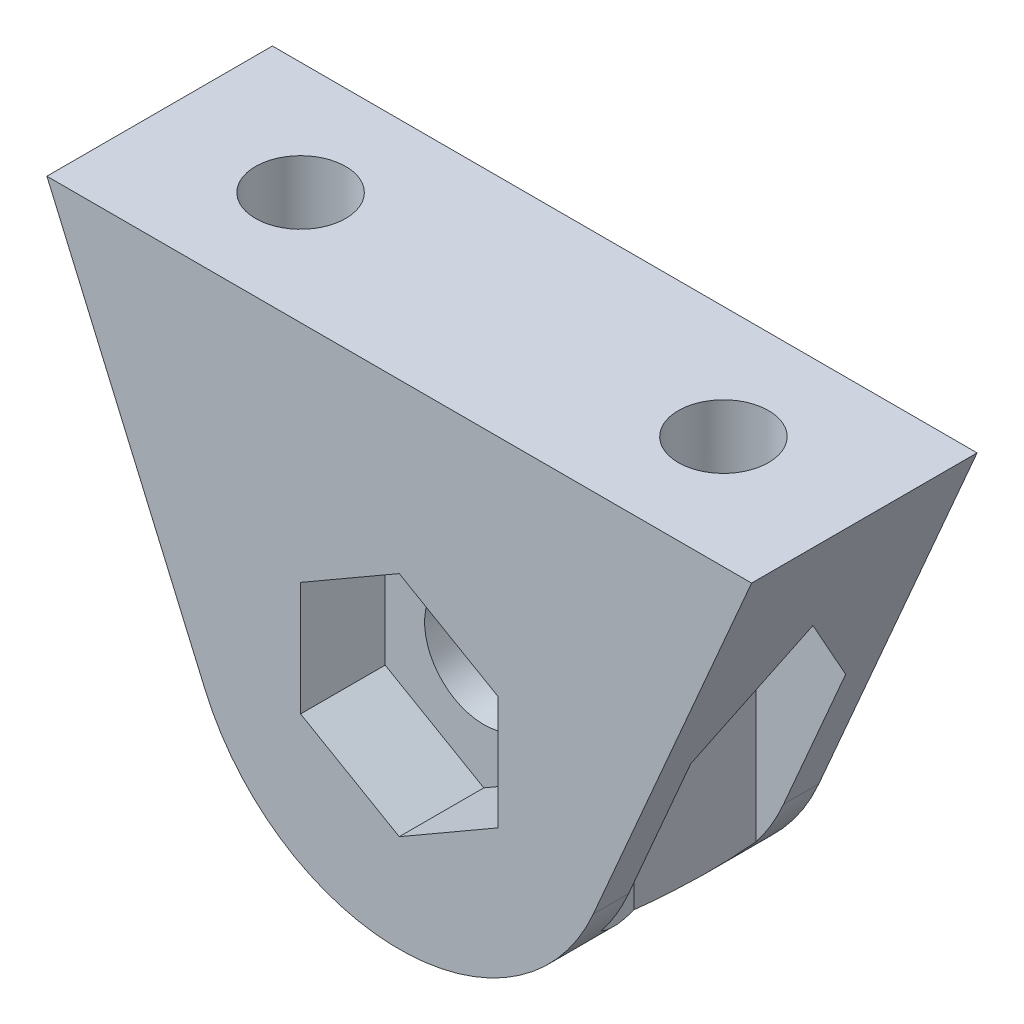
ISO-10303-21;
HEADER;
FILE_DESCRIPTION(('STEP AP214'),'2;1');
FILE_NAME('part.step','',(''),(''),'','','');
FILE_SCHEMA(('AUTOMOTIVE_DESIGN { 1 0 10303 214 1 1 1 1 }'));
ENDSEC;
DATA;
#1=APPLICATION_CONTEXT('core data for automotive mechanical design processes');
#2=APPLICATION_PROTOCOL_DEFINITION('international standard','automotive_design',2000,#1);
#3=PRODUCT_CONTEXT('',#1,'mechanical');
#4=PRODUCT('Part','Part','',(#3));
#5=PRODUCT_RELATED_PRODUCT_CATEGORY('part','',(#4));
#6=PRODUCT_DEFINITION_FORMATION('','',#4);
#7=PRODUCT_DEFINITION_CONTEXT('part definition',#1,'design');
#8=PRODUCT_DEFINITION('design','',#6,#7);
#9=PRODUCT_DEFINITION_SHAPE('','',#8);
#10=(LENGTH_UNIT() NAMED_UNIT(*) SI_UNIT(.MILLI.,.METRE.));
#11=(NAMED_UNIT(*) PLANE_ANGLE_UNIT() SI_UNIT($,.RADIAN.));
#12=(NAMED_UNIT(*) SI_UNIT($,.STERADIAN.) SOLID_ANGLE_UNIT());
#13=UNCERTAINTY_MEASURE_WITH_UNIT(LENGTH_MEASURE(1.E-05),#10,'distance_accuracy_value','');
#14=(GEOMETRIC_REPRESENTATION_CONTEXT(3) GLOBAL_UNCERTAINTY_ASSIGNED_CONTEXT((#13)) GLOBAL_UNIT_ASSIGNED_CONTEXT((#10,
#11,#12)) REPRESENTATION_CONTEXT('',''));
#15=CARTESIAN_POINT('',(0.,0.,0.));
#16=DIRECTION('',(0.,0.,1.));
#17=DIRECTION('',(1.,0.,0.));
#18=AXIS2_PLACEMENT_3D('',#15,#16,#17);
#19=CARTESIAN_POINT('',(7.5,-7.5,4.));
#20=DIRECTION('',(0.,1.,0.));
#21=DIRECTION('',(0.,0.,1.));
#22=AXIS2_PLACEMENT_3D('',#19,#20,#21);
#23=CYLINDRICAL_SURFACE('',#22,1.6);
#24=CARTESIAN_POINT('',(7.5,10.,4.));
#25=DIRECTION('',(0.,1.,0.));
#26=DIRECTION('',(0.,0.,1.));
#27=AXIS2_PLACEMENT_3D('',#24,#25,#26);
#28=CIRCLE('',#27,1.6);
#29=CARTESIAN_POINT('',(7.5,10.,5.6));
#30=VERTEX_POINT('',#29);
#31=EDGE_CURVE('E330',#30,#30,#28,.T.);
#32=ORIENTED_EDGE('',*,*,#31,.T.);
#33=EDGE_LOOP('',(#32));
#34=FACE_BOUND('',#33,.T.);
#35=CARTESIAN_POINT('',(7.5,7.,4.));
#36=DIRECTION('',(0.,-1.,0.));
#37=DIRECTION('',(0.,0.,-1.));
#38=AXIS2_PLACEMENT_3D('',#35,#36,#37);
#39=CIRCLE('',#38,1.6);
#40=CARTESIAN_POINT('',(7.5,7.,2.4));
#41=VERTEX_POINT('',#40);
#42=EDGE_CURVE('E233',#41,#41,#39,.F.);
#43=ORIENTED_EDGE('',*,*,#42,.F.);
#44=EDGE_LOOP('',(#43));
#45=FACE_BOUND('',#44,.T.);
#46=ADVANCED_FACE('F32',(#34,#45),#23,.F.);
#47=CARTESIAN_POINT('',(0.,0.,8.));
#48=DIRECTION('',(0.,0.,-1.));
#49=DIRECTION('',(-1.,0.,0.));
#50=AXIS2_PLACEMENT_3D('',#47,#48,#49);
#51=CYLINDRICAL_SURFACE('',#50,2.1);
#52=CARTESIAN_POINT('',(0.,0.,0.));
#53=DIRECTION('',(0.,0.,1.));
#54=DIRECTION('',(1.,0.,0.));
#55=AXIS2_PLACEMENT_3D('',#52,#53,#54);
#56=CIRCLE('',#55,2.1);
#57=CARTESIAN_POINT('',(2.1,0.,0.));
#58=VERTEX_POINT('',#57);
#59=EDGE_CURVE('E329',#58,#58,#56,.T.);
#60=ORIENTED_EDGE('',*,*,#59,.F.);
#61=EDGE_LOOP('',(#60));
#62=FACE_BOUND('',#61,.T.);
#63=CARTESIAN_POINT('',(0.,0.,5.));
#64=DIRECTION('',(0.,0.,1.));
#65=DIRECTION('',(1.,0.,0.));
#66=AXIS2_PLACEMENT_3D('',#63,#64,#65);
#67=CIRCLE('',#66,2.1);
#68=CARTESIAN_POINT('',(2.1,0.,5.));
#69=VERTEX_POINT('',#68);
#70=EDGE_CURVE('E315',#69,#69,#67,.T.);
#71=ORIENTED_EDGE('',*,*,#70,.T.);
#72=EDGE_LOOP('',(#71));
#73=FACE_BOUND('',#72,.T.);
#74=ADVANCED_FACE('F432',(#62,#73),#51,.F.);
#75=CARTESIAN_POINT('',(0.,0.,8.));
#76=DIRECTION('',(0.,0.,1.));
#77=DIRECTION('',(1.,0.,0.));
#78=AXIS2_PLACEMENT_3D('',#75,#76,#77);
#79=PLANE('',#78);
#80=DIRECTION('',(0.866025403784439,-0.5,0.));
#81=VECTOR('',#80,1.);
#82=CARTESIAN_POINT('',(-3.5,-2.02072594216369,8.));
#83=LINE('',#82,#81);
#84=CARTESIAN_POINT('',(-3.5,-2.02072594216369,8.));
#85=VERTEX_POINT('',#84);
#86=CARTESIAN_POINT('',(0.,-4.04145188432738,8.));
#87=VERTEX_POINT('',#86);
#88=EDGE_CURVE('E277',#85,#87,#83,.T.);
#89=ORIENTED_EDGE('',*,*,#88,.F.);
#90=DIRECTION('',(0.,-1.,0.));
#91=VECTOR('',#90,1.);
#92=CARTESIAN_POINT('',(-3.5,2.02072594216369,8.));
#93=LINE('',#92,#91);
#94=CARTESIAN_POINT('',(-3.5,2.02072594216369,8.));
#95=VERTEX_POINT('',#94);
#96=EDGE_CURVE('E282',#95,#85,#93,.T.);
#97=ORIENTED_EDGE('',*,*,#96,.F.);
#98=DIRECTION('',(-0.866025403784439,-0.5,0.));
#99=VECTOR('',#98,1.);
#100=CARTESIAN_POINT('',(0.,4.04145188432738,8.));
#101=LINE('',#100,#99);
#102=CARTESIAN_POINT('',(0.,4.04145188432738,8.));
#103=VERTEX_POINT('',#102);
#104=EDGE_CURVE('E308',#103,#95,#101,.T.);
#105=ORIENTED_EDGE('',*,*,#104,.F.);
#106=DIRECTION('',(-0.866025403784439,0.5,0.));
#107=VECTOR('',#106,1.);
#108=CARTESIAN_POINT('',(3.5,2.02072594216369,8.));
#109=LINE('',#108,#107);
#110=CARTESIAN_POINT('',(3.5,2.02072594216369,8.));
#111=VERTEX_POINT('',#110);
#112=EDGE_CURVE('E305',#111,#103,#109,.T.);
#113=ORIENTED_EDGE('',*,*,#112,.F.);
#114=DIRECTION('',(0.,1.,0.));
#115=VECTOR('',#114,1.);
#116=CARTESIAN_POINT('',(3.5,-2.02072594216369,8.));
#117=LINE('',#116,#115);
#118=CARTESIAN_POINT('',(3.5,-2.02072594216369,8.));
#119=VERTEX_POINT('',#118);
#120=EDGE_CURVE('E302',#119,#111,#117,.T.);
#121=ORIENTED_EDGE('',*,*,#120,.F.);
#122=DIRECTION('',(0.866025403784439,0.5,0.));
#123=VECTOR('',#122,1.);
#124=CARTESIAN_POINT('',(0.,-4.04145188432738,8.));
#125=LINE('',#124,#123);
#126=EDGE_CURVE('E299',#87,#119,#125,.T.);
#127=ORIENTED_EDGE('',*,*,#126,.F.);
#128=EDGE_LOOP('',(#89,#97,#105,#113,#121,#127));
#129=FACE_BOUND('',#128,.T.);
#130=CARTESIAN_POINT('',(0.,0.,8.));
#131=DIRECTION('',(0.,0.,1.));
#132=DIRECTION('',(1.,0.,0.));
#133=AXIS2_PLACEMENT_3D('',#130,#131,#132);
#134=CIRCLE('',#133,7.5);
#135=CARTESIAN_POINT('',(-6.88306408499442,-2.97883010624303,8.));
#136=VERTEX_POINT('',#135);
#137=CARTESIAN_POINT('',(6.88306408499442,-2.97883010624303,8.));
#138=VERTEX_POINT('',#137);
#139=EDGE_CURVE('E336',#136,#138,#134,.T.);
#140=ORIENTED_EDGE('',*,*,#139,.T.);
#141=DIRECTION('',(0.397177347499071,0.917741877999257,0.));
#142=VECTOR('',#141,1.);
#143=CARTESIAN_POINT('',(6.88306408499442,-2.97883010624303,8.));
#144=LINE('',#143,#142);
#145=CARTESIAN_POINT('',(12.5,10.,8.));
#146=VERTEX_POINT('',#145);
#147=EDGE_CURVE('E339',#138,#146,#144,.T.);
#148=ORIENTED_EDGE('',*,*,#147,.T.);
#149=DIRECTION('',(-1.,0.,0.));
#150=VECTOR('',#149,1.);
#151=CARTESIAN_POINT('',(-12.5,10.,8.));
#152=LINE('',#151,#150);
#153=CARTESIAN_POINT('',(-12.5,10.,8.));
#154=VERTEX_POINT('',#153);
#155=EDGE_CURVE('E342',#146,#154,#152,.T.);
#156=ORIENTED_EDGE('',*,*,#155,.T.);
#157=DIRECTION('',(0.397177347499071,-0.917741877999257,0.));
#158=VECTOR('',#157,1.);
#159=CARTESIAN_POINT('',(-6.88306408499442,-2.97883010624303,8.));
#160=LINE('',#159,#158);
#161=EDGE_CURVE('E344',#154,#136,#160,.T.);
#162=ORIENTED_EDGE('',*,*,#161,.T.);
#163=EDGE_LOOP('',(#140,#148,#156,#162));
#164=FACE_BOUND('',#163,.T.);
#165=ADVANCED_FACE('F438',(#129,#164),#79,.T.);
#166=CARTESIAN_POINT('',(0.,0.,0.));
#167=DIRECTION('',(0.,0.,1.));
#168=DIRECTION('',(1.,0.,0.));
#169=AXIS2_PLACEMENT_3D('',#166,#167,#168);
#170=PLANE('',#169);
#171=CARTESIAN_POINT('',(0.,0.,0.));
#172=DIRECTION('',(0.,0.,1.));
#173=DIRECTION('',(1.,0.,0.));
#174=AXIS2_PLACEMENT_3D('',#171,#172,#173);
#175=CIRCLE('',#174,7.5);
#176=CARTESIAN_POINT('',(-6.88306408499442,-2.97883010624303,0.));
#177=VERTEX_POINT('',#176);
#178=CARTESIAN_POINT('',(6.88306408499442,-2.97883010624303,0.));
#179=VERTEX_POINT('',#178);
#180=EDGE_CURVE('E335',#177,#179,#175,.T.);
#181=ORIENTED_EDGE('',*,*,#180,.F.);
#182=DIRECTION('',(0.397177347499071,-0.917741877999257,0.));
#183=VECTOR('',#182,1.);
#184=CARTESIAN_POINT('',(-6.88306408499442,-2.97883010624303,0.));
#185=LINE('',#184,#183);
#186=CARTESIAN_POINT('',(-12.5,10.,0.));
#187=VERTEX_POINT('',#186);
#188=EDGE_CURVE('E340',#187,#177,#185,.T.);
#189=ORIENTED_EDGE('',*,*,#188,.F.);
#190=DIRECTION('',(-1.,0.,0.));
#191=VECTOR('',#190,1.);
#192=CARTESIAN_POINT('',(-12.5,10.,0.));
#193=LINE('',#192,#191);
#194=CARTESIAN_POINT('',(12.5,10.,0.));
#195=VERTEX_POINT('',#194);
#196=EDGE_CURVE('E351',#195,#187,#193,.T.);
#197=ORIENTED_EDGE('',*,*,#196,.F.);
#198=DIRECTION('',(0.397177347499071,0.917741877999257,0.));
#199=VECTOR('',#198,1.);
#200=CARTESIAN_POINT('',(6.88306408499442,-2.97883010624303,0.));
#201=LINE('',#200,#199);
#202=EDGE_CURVE('E349',#179,#195,#201,.T.);
#203=ORIENTED_EDGE('',*,*,#202,.F.);
#204=EDGE_LOOP('',(#181,#189,#197,#203));
#205=FACE_BOUND('',#204,.T.);
#206=ORIENTED_EDGE('',*,*,#59,.T.);
#207=EDGE_LOOP('',(#206));
#208=FACE_BOUND('',#207,.T.);
#209=ADVANCED_FACE('F448',(#205,#208),#170,.F.);
#210=CARTESIAN_POINT('',(0.,0.,8.));
#211=DIRECTION('',(0.,0.,-1.));
#212=DIRECTION('',(-1.,0.,0.));
#213=AXIS2_PLACEMENT_3D('',#210,#211,#212);
#214=CYLINDRICAL_SURFACE('',#213,7.5);
#215=DIRECTION('',(0.,0.,-1.));
#216=VECTOR('',#215,1.);
#217=CARTESIAN_POINT('',(-6.88306408499442,-2.97883010624303,8.));
#218=LINE('',#217,#216);
#219=CARTESIAN_POINT('',(-6.88306408499442,-2.97883010624303,6.75));
#220=VERTEX_POINT('',#219);
#221=EDGE_CURVE('E355',#136,#220,#218,.T.);
#222=ORIENTED_EDGE('',*,*,#221,.T.);
#223=CARTESIAN_POINT('',(0.,0.,6.75));
#224=DIRECTION('',(0.,0.,1.));
#225=DIRECTION('',(1.,0.,0.));
#226=AXIS2_PLACEMENT_3D('',#223,#224,#225);
#227=CIRCLE('',#226,7.5);
#228=CARTESIAN_POINT('',(-5.91228675972853,-4.61463598464047,6.75));
#229=VERTEX_POINT('',#228);
#230=EDGE_CURVE('E268',#220,#229,#227,.T.);
#231=ORIENTED_EDGE('',*,*,#230,.T.);
#232=CARTESIAN_POINT('',(0.,0.,-3.49038105676658));
#233=DIRECTION('',(0.866025403784439,0.,0.5));
#234=DIRECTION('',(0.5,0.,-0.866025403784439));
#235=AXIS2_PLACEMENT_3D('',#232,#233,#234);
#236=ELLIPSE('',#235,15.,7.5);
#237=CARTESIAN_POINT('',(-4.32457351945706,-6.12764749922927,4.));
#238=VERTEX_POINT('',#237);
#239=EDGE_CURVE('E40',#229,#238,#236,.T.);
#240=ORIENTED_EDGE('',*,*,#239,.T.);
#241=CARTESIAN_POINT('',(0.,0.,11.4903810567666));
#242=DIRECTION('',(0.866025403784439,0.,-0.5));
#243=DIRECTION('',(-0.5,0.,-0.866025403784439));
#244=AXIS2_PLACEMENT_3D('',#241,#242,#243);
#245=ELLIPSE('',#244,15.,7.5);
#246=CARTESIAN_POINT('',(-5.91228675972853,-4.61463598464047,1.25));
#247=VERTEX_POINT('',#246);
#248=EDGE_CURVE('E11',#238,#247,#245,.T.);
#249=ORIENTED_EDGE('',*,*,#248,.T.);
#250=CARTESIAN_POINT('',(0.,0.,1.25));
#251=DIRECTION('',(0.,0.,-1.));
#252=DIRECTION('',(-1.,0.,0.));
#253=AXIS2_PLACEMENT_3D('',#250,#251,#252);
#254=CIRCLE('',#253,7.5);
#255=CARTESIAN_POINT('',(-6.88306408499442,-2.97883010624303,1.25));
#256=VERTEX_POINT('',#255);
#257=EDGE_CURVE('E265',#247,#256,#254,.T.);
#258=ORIENTED_EDGE('',*,*,#257,.T.);
#259=EDGE_CURVE('E346',#256,#177,#218,.T.);
#260=ORIENTED_EDGE('',*,*,#259,.T.);
#261=ORIENTED_EDGE('',*,*,#180,.T.);
#262=DIRECTION('',(0.,0.,-1.));
#263=VECTOR('',#262,1.);
#264=CARTESIAN_POINT('',(6.88306408499442,-2.97883010624303,8.));
#265=LINE('',#264,#263);
#266=CARTESIAN_POINT('',(6.88306408499442,-2.97883010624303,1.25));
#267=VERTEX_POINT('',#266);
#268=EDGE_CURVE('E364',#267,#179,#265,.T.);
#269=ORIENTED_EDGE('',*,*,#268,.F.);
#270=CARTESIAN_POINT('',(0.,0.,1.25));
#271=DIRECTION('',(0.,0.,-1.));
#272=DIRECTION('',(-1.,0.,0.));
#273=AXIS2_PLACEMENT_3D('',#270,#271,#272);
#274=CIRCLE('',#273,7.5);
#275=CARTESIAN_POINT('',(5.91228675972853,-4.61463598464047,1.25));
#276=VERTEX_POINT('',#275);
#277=EDGE_CURVE('E271',#267,#276,#274,.T.);
#278=ORIENTED_EDGE('',*,*,#277,.T.);
#279=CARTESIAN_POINT('',(0.,0.,11.4903810567666));
#280=DIRECTION('',(-0.866025403784439,0.,-0.499999999999999));
#281=DIRECTION('',(0.499999999999999,0.,-0.866025403784439));
#282=AXIS2_PLACEMENT_3D('',#279,#280,#281);
#283=ELLIPSE('',#282,15.,7.5);
#284=CARTESIAN_POINT('',(4.32457351945706,-6.12764749922927,4.));
#285=VERTEX_POINT('',#284);
#286=EDGE_CURVE('E398',#276,#285,#283,.T.);
#287=ORIENTED_EDGE('',*,*,#286,.T.);
#288=CARTESIAN_POINT('',(0.,0.,-3.49038105676658));
#289=DIRECTION('',(-0.866025403784438,0.,0.5));
#290=DIRECTION('',(-0.5,0.,-0.866025403784439));
#291=AXIS2_PLACEMENT_3D('',#288,#289,#290);
#292=ELLIPSE('',#291,15.,7.5);
#293=CARTESIAN_POINT('',(5.91228675972853,-4.61463598464047,6.75));
#294=VERTEX_POINT('',#293);
#295=EDGE_CURVE('E401',#285,#294,#292,.T.);
#296=ORIENTED_EDGE('',*,*,#295,.T.);
#297=CARTESIAN_POINT('',(0.,0.,6.75));
#298=DIRECTION('',(0.,0.,1.));
#299=DIRECTION('',(1.,0.,0.));
#300=AXIS2_PLACEMENT_3D('',#297,#298,#299);
#301=CIRCLE('',#300,7.5);
#302=CARTESIAN_POINT('',(6.88306408499442,-2.97883010624303,6.75));
#303=VERTEX_POINT('',#302);
#304=EDGE_CURVE('E274',#294,#303,#301,.T.);
#305=ORIENTED_EDGE('',*,*,#304,.T.);
#306=EDGE_CURVE('E365',#138,#303,#265,.T.);
#307=ORIENTED_EDGE('',*,*,#306,.F.);
#308=ORIENTED_EDGE('',*,*,#139,.F.);
#309=EDGE_LOOP('',(#222,#231,#240,#249,#258,#260,#261,#269,#278,#287,#296,#305,#307,#308));
#310=FACE_BOUND('',#309,.T.);
#311=ADVANCED_FACE('F34',(#310),#214,.T.);
#312=CARTESIAN_POINT('',(6.88306408499442,-2.97883010624303,8.));
#313=DIRECTION('',(-0.917741877999257,0.397177347499071,0.));
#314=DIRECTION('',(-0.397177347499071,-0.917741877999257,0.));
#315=AXIS2_PLACEMENT_3D('',#312,#313,#314);
#316=PLANE('',#315);
#317=ORIENTED_EDGE('',*,*,#306,.T.);
#318=DIRECTION('',(0.397177347499071,0.917741877999257,0.));
#319=VECTOR('',#318,1.);
#320=CARTESIAN_POINT('',(6.88306408499442,-2.97883010624303,6.75));
#321=LINE('',#320,#319);
#322=CARTESIAN_POINT('',(9.08771324027147,2.11536488960366,6.74999999999999));
#323=VERTEX_POINT('',#322);
#324=EDGE_CURVE('E395',#303,#323,#321,.T.);
#325=ORIENTED_EDGE('',*,*,#324,.T.);
#326=DIRECTION('',(0.327224878100445,0.756105493042205,-0.566770114370504));
#327=VECTOR('',#326,1.);
#328=CARTESIAN_POINT('',(7.35943332114477,-1.87810268520925,9.74346862962848));
#329=LINE('',#328,#327);
#330=CARTESIAN_POINT('',(10.6754264805429,5.78403063810643,3.99999999999999));
#331=VERTEX_POINT('',#330);
#332=EDGE_CURVE('E392',#323,#331,#329,.T.);
#333=ORIENTED_EDGE('',*,*,#332,.T.);
#334=DIRECTION('',(-0.327224878100445,-0.756105493042205,-0.566770114370503));
#335=VECTOR('',#334,1.);
#336=CARTESIAN_POINT('',(8.84312357383167,1.55020128893231,0.826358270719947));
#337=LINE('',#336,#335);
#338=CARTESIAN_POINT('',(9.08771324027147,2.11536488960367,1.25));
#339=VERTEX_POINT('',#338);
#340=EDGE_CURVE('E386',#331,#339,#337,.T.);
#341=ORIENTED_EDGE('',*,*,#340,.T.);
#342=DIRECTION('',(-0.397177347499071,-0.917741877999257,0.));
#343=VECTOR('',#342,1.);
#344=CARTESIAN_POINT('',(6.88306408499442,-2.97883010624303,1.25));
#345=LINE('',#344,#343);
#346=EDGE_CURVE('E389',#339,#267,#345,.T.);
#347=ORIENTED_EDGE('',*,*,#346,.T.);
#348=ORIENTED_EDGE('',*,*,#268,.T.);
#349=ORIENTED_EDGE('',*,*,#202,.T.);
#350=DIRECTION('',(0.,0.,-1.));
#351=VECTOR('',#350,1.);
#352=CARTESIAN_POINT('',(12.5,10.,8.));
#353=LINE('',#352,#351);
#354=EDGE_CURVE('E361',#146,#195,#353,.T.);
#355=ORIENTED_EDGE('',*,*,#354,.F.);
#356=ORIENTED_EDGE('',*,*,#147,.F.);
#357=EDGE_LOOP('',(#317,#325,#333,#341,#347,#348,#349,#355,#356));
#358=FACE_BOUND('',#357,.T.);
#359=ADVANCED_FACE('F457',(#358),#316,.F.);
#360=CARTESIAN_POINT('',(-12.5,10.,8.));
#361=DIRECTION('',(0.,-1.,0.));
#362=DIRECTION('',(0.,0.,-1.));
#363=AXIS2_PLACEMENT_3D('',#360,#361,#362);
#364=PLANE('',#363);
#365=CARTESIAN_POINT('',(-7.5,10.,4.));
#366=DIRECTION('',(0.,1.,0.));
#367=DIRECTION('',(0.,0.,1.));
#368=AXIS2_PLACEMENT_3D('',#365,#366,#367);
#369=CIRCLE('',#368,1.6);
#370=CARTESIAN_POINT('',(-7.5,10.,5.6));
#371=VERTEX_POINT('',#370);
#372=EDGE_CURVE('E326',#371,#371,#369,.T.);
#373=ORIENTED_EDGE('',*,*,#372,.F.);
#374=EDGE_LOOP('',(#373));
#375=FACE_BOUND('',#374,.T.);
#376=ORIENTED_EDGE('',*,*,#31,.F.);
#377=EDGE_LOOP('',(#376));
#378=FACE_BOUND('',#377,.T.);
#379=ORIENTED_EDGE('',*,*,#196,.T.);
#380=DIRECTION('',(0.,0.,-1.));
#381=VECTOR('',#380,1.);
#382=CARTESIAN_POINT('',(-12.5,10.,8.));
#383=LINE('',#382,#381);
#384=EDGE_CURVE('E358',#154,#187,#383,.T.);
#385=ORIENTED_EDGE('',*,*,#384,.F.);
#386=ORIENTED_EDGE('',*,*,#155,.F.);
#387=ORIENTED_EDGE('',*,*,#354,.T.);
#388=EDGE_LOOP('',(#379,#385,#386,#387));
#389=FACE_BOUND('',#388,.T.);
#390=ADVANCED_FACE('F455',(#375,#378,#389),#364,.F.);
#391=CARTESIAN_POINT('',(-6.88306408499442,-2.97883010624303,8.));
#392=DIRECTION('',(0.917741877999257,0.397177347499071,0.));
#393=DIRECTION('',(-0.397177347499071,0.917741877999257,0.));
#394=AXIS2_PLACEMENT_3D('',#391,#392,#393);
#395=PLANE('',#394);
#396=DIRECTION('',(0.327224878100445,-0.756105493042205,0.566770114370504));
#397=VECTOR('',#396,1.);
#398=CARTESIAN_POINT('',(-7.35943332114477,-1.87810268520925,9.74346862962848));
#399=LINE('',#398,#397);
#400=CARTESIAN_POINT('',(-10.6754264805429,5.78403063810643,4.));
#401=VERTEX_POINT('',#400);
#402=CARTESIAN_POINT('',(-9.08771324027147,2.11536488960366,6.75));
#403=VERTEX_POINT('',#402);
#404=EDGE_CURVE('E380',#401,#403,#399,.T.);
#405=ORIENTED_EDGE('',*,*,#404,.T.);
#406=DIRECTION('',(0.397177347499071,-0.917741877999257,0.));
#407=VECTOR('',#406,1.);
#408=CARTESIAN_POINT('',(-6.88306408499442,-2.97883010624303,6.75));
#409=LINE('',#408,#407);
#410=EDGE_CURVE('E383',#403,#220,#409,.T.);
#411=ORIENTED_EDGE('',*,*,#410,.T.);
#412=ORIENTED_EDGE('',*,*,#221,.F.);
#413=ORIENTED_EDGE('',*,*,#161,.F.);
#414=ORIENTED_EDGE('',*,*,#384,.T.);
#415=ORIENTED_EDGE('',*,*,#188,.T.);
#416=ORIENTED_EDGE('',*,*,#259,.F.);
#417=DIRECTION('',(-0.397177347499071,0.917741877999257,0.));
#418=VECTOR('',#417,1.);
#419=CARTESIAN_POINT('',(-6.88306408499442,-2.97883010624303,1.25));
#420=LINE('',#419,#418);
#421=CARTESIAN_POINT('',(-9.08771324027147,2.11536488960366,1.25));
#422=VERTEX_POINT('',#421);
#423=EDGE_CURVE('E368',#256,#422,#420,.T.);
#424=ORIENTED_EDGE('',*,*,#423,.T.);
#425=DIRECTION('',(-0.327224878100445,0.756105493042205,0.566770114370503));
#426=VECTOR('',#425,1.);
#427=CARTESIAN_POINT('',(-8.84312357383167,1.55020128893231,0.826358270719948));
#428=LINE('',#427,#426);
#429=EDGE_CURVE('E377',#422,#401,#428,.T.);
#430=ORIENTED_EDGE('',*,*,#429,.T.);
#431=EDGE_LOOP('',(#405,#411,#412,#413,#414,#415,#416,#424,#430));
#432=FACE_BOUND('',#431,.T.);
#433=ADVANCED_FACE('F407',(#432),#395,.F.);
#434=CARTESIAN_POINT('',(-7.5,-7.5,4.));
#435=DIRECTION('',(0.,1.,0.));
#436=DIRECTION('',(0.,0.,1.));
#437=AXIS2_PLACEMENT_3D('',#434,#435,#436);
#438=CYLINDRICAL_SURFACE('',#437,1.6);
#439=CARTESIAN_POINT('',(-7.5,7.,4.));
#440=DIRECTION('',(0.,1.,0.));
#441=DIRECTION('',(0.,0.,1.));
#442=AXIS2_PLACEMENT_3D('',#439,#440,#441);
#443=CIRCLE('',#442,1.6);
#444=CARTESIAN_POINT('',(-7.5,7.,5.6));
#445=VERTEX_POINT('',#444);
#446=EDGE_CURVE('E269',#445,#445,#443,.F.);
#447=ORIENTED_EDGE('',*,*,#446,.T.);
#448=EDGE_LOOP('',(#447));
#449=FACE_BOUND('',#448,.T.);
#450=ORIENTED_EDGE('',*,*,#372,.T.);
#451=EDGE_LOOP('',(#450));
#452=FACE_BOUND('',#451,.T.);
#453=ADVANCED_FACE('F443',(#449,#452),#438,.F.);
#454=CARTESIAN_POINT('',(-3.5,-2.02072594216369,5.));
#455=DIRECTION('',(-0.5,-0.866025403784439,0.));
#456=DIRECTION('',(0.866025403784439,-0.5,0.));
#457=AXIS2_PLACEMENT_3D('',#454,#455,#456);
#458=PLANE('',#457);
#459=ORIENTED_EDGE('',*,*,#88,.T.);
#460=DIRECTION('',(0.,0.,1.));
#461=VECTOR('',#460,1.);
#462=CARTESIAN_POINT('',(0.,-4.04145188432738,5.));
#463=LINE('',#462,#461);
#464=CARTESIAN_POINT('',(0.,-4.04145188432738,5.));
#465=VERTEX_POINT('',#464);
#466=EDGE_CURVE('E297',#465,#87,#463,.T.);
#467=ORIENTED_EDGE('',*,*,#466,.F.);
#468=DIRECTION('',(0.866025403784439,-0.5,0.));
#469=VECTOR('',#468,1.);
#470=CARTESIAN_POINT('',(-3.5,-2.02072594216369,5.));
#471=LINE('',#470,#469);
#472=CARTESIAN_POINT('',(-3.5,-2.02072594216369,5.));
#473=VERTEX_POINT('',#472);
#474=EDGE_CURVE('E278',#473,#465,#471,.T.);
#475=ORIENTED_EDGE('',*,*,#474,.F.);
#476=DIRECTION('',(0.,0.,1.));
#477=VECTOR('',#476,1.);
#478=CARTESIAN_POINT('',(-3.5,-2.02072594216369,5.));
#479=LINE('',#478,#477);
#480=EDGE_CURVE('E313',#473,#85,#479,.T.);
#481=ORIENTED_EDGE('',*,*,#480,.T.);
#482=EDGE_LOOP('',(#459,#467,#475,#481));
#483=FACE_BOUND('',#482,.T.);
#484=ADVANCED_FACE('F510',(#483),#458,.F.);
#485=CARTESIAN_POINT('',(-3.5,2.02072594216369,5.));
#486=DIRECTION('',(-1.,0.,0.));
#487=DIRECTION('',(0.,-1.,0.));
#488=AXIS2_PLACEMENT_3D('',#485,#486,#487);
#489=PLANE('',#488);
#490=ORIENTED_EDGE('',*,*,#96,.T.);
#491=ORIENTED_EDGE('',*,*,#480,.F.);
#492=DIRECTION('',(0.,-1.,0.));
#493=VECTOR('',#492,1.);
#494=CARTESIAN_POINT('',(-3.5,2.02072594216369,5.));
#495=LINE('',#494,#493);
#496=CARTESIAN_POINT('',(-3.5,2.02072594216369,5.));
#497=VERTEX_POINT('',#496);
#498=EDGE_CURVE('E294',#497,#473,#495,.T.);
#499=ORIENTED_EDGE('',*,*,#498,.F.);
#500=DIRECTION('',(0.,0.,1.));
#501=VECTOR('',#500,1.);
#502=CARTESIAN_POINT('',(-3.5,2.02072594216369,5.));
#503=LINE('',#502,#501);
#504=EDGE_CURVE('E316',#497,#95,#503,.T.);
#505=ORIENTED_EDGE('',*,*,#504,.T.);
#506=EDGE_LOOP('',(#490,#491,#499,#505));
#507=FACE_BOUND('',#506,.T.);
#508=ADVANCED_FACE('F528',(#507),#489,.F.);
#509=CARTESIAN_POINT('',(0.,4.04145188432738,5.));
#510=DIRECTION('',(-0.5,0.866025403784438,0.));
#511=DIRECTION('',(-0.866025403784439,-0.5,0.));
#512=AXIS2_PLACEMENT_3D('',#509,#510,#511);
#513=PLANE('',#512);
#514=ORIENTED_EDGE('',*,*,#104,.T.);
#515=ORIENTED_EDGE('',*,*,#504,.F.);
#516=DIRECTION('',(-0.866025403784439,-0.5,0.));
#517=VECTOR('',#516,1.);
#518=CARTESIAN_POINT('',(0.,4.04145188432738,5.));
#519=LINE('',#518,#517);
#520=CARTESIAN_POINT('',(0.,4.04145188432738,5.));
#521=VERTEX_POINT('',#520);
#522=EDGE_CURVE('E291',#521,#497,#519,.T.);
#523=ORIENTED_EDGE('',*,*,#522,.F.);
#524=DIRECTION('',(0.,0.,1.));
#525=VECTOR('',#524,1.);
#526=CARTESIAN_POINT('',(0.,4.04145188432738,5.));
#527=LINE('',#526,#525);
#528=EDGE_CURVE('E318',#521,#103,#527,.T.);
#529=ORIENTED_EDGE('',*,*,#528,.T.);
#530=EDGE_LOOP('',(#514,#515,#523,#529));
#531=FACE_BOUND('',#530,.T.);
#532=ADVANCED_FACE('F525',(#531),#513,.F.);
#533=CARTESIAN_POINT('',(3.5,2.02072594216369,5.));
#534=DIRECTION('',(0.5,0.866025403784439,0.));
#535=DIRECTION('',(-0.866025403784439,0.5,0.));
#536=AXIS2_PLACEMENT_3D('',#533,#534,#535);
#537=PLANE('',#536);
#538=ORIENTED_EDGE('',*,*,#112,.T.);
#539=ORIENTED_EDGE('',*,*,#528,.F.);
#540=DIRECTION('',(-0.866025403784439,0.5,0.));
#541=VECTOR('',#540,1.);
#542=CARTESIAN_POINT('',(3.5,2.02072594216369,5.));
#543=LINE('',#542,#541);
#544=CARTESIAN_POINT('',(3.5,2.02072594216369,5.));
#545=VERTEX_POINT('',#544);
#546=EDGE_CURVE('E288',#545,#521,#543,.T.);
#547=ORIENTED_EDGE('',*,*,#546,.F.);
#548=DIRECTION('',(0.,0.,1.));
#549=VECTOR('',#548,1.);
#550=CARTESIAN_POINT('',(3.5,2.02072594216369,5.));
#551=LINE('',#550,#549);
#552=EDGE_CURVE('E320',#545,#111,#551,.T.);
#553=ORIENTED_EDGE('',*,*,#552,.T.);
#554=EDGE_LOOP('',(#538,#539,#547,#553));
#555=FACE_BOUND('',#554,.T.);
#556=ADVANCED_FACE('F521',(#555),#537,.F.);
#557=CARTESIAN_POINT('',(3.5,-2.02072594216369,5.));
#558=DIRECTION('',(1.,0.,0.));
#559=DIRECTION('',(0.,1.,0.));
#560=AXIS2_PLACEMENT_3D('',#557,#558,#559);
#561=PLANE('',#560);
#562=ORIENTED_EDGE('',*,*,#120,.T.);
#563=ORIENTED_EDGE('',*,*,#552,.F.);
#564=DIRECTION('',(0.,1.,0.));
#565=VECTOR('',#564,1.);
#566=CARTESIAN_POINT('',(3.5,-2.02072594216369,5.));
#567=LINE('',#566,#565);
#568=CARTESIAN_POINT('',(3.5,-2.02072594216369,5.));
#569=VERTEX_POINT('',#568);
#570=EDGE_CURVE('E285',#569,#545,#567,.T.);
#571=ORIENTED_EDGE('',*,*,#570,.F.);
#572=DIRECTION('',(0.,0.,1.));
#573=VECTOR('',#572,1.);
#574=CARTESIAN_POINT('',(3.5,-2.02072594216369,5.));
#575=LINE('',#574,#573);
#576=EDGE_CURVE('E322',#569,#119,#575,.T.);
#577=ORIENTED_EDGE('',*,*,#576,.T.);
#578=EDGE_LOOP('',(#562,#563,#571,#577));
#579=FACE_BOUND('',#578,.T.);
#580=ADVANCED_FACE('F517',(#579),#561,.F.);
#581=CARTESIAN_POINT('',(0.,-4.04145188432738,5.));
#582=DIRECTION('',(0.5,-0.866025403784438,0.));
#583=DIRECTION('',(0.866025403784439,0.5,0.));
#584=AXIS2_PLACEMENT_3D('',#581,#582,#583);
#585=PLANE('',#584);
#586=ORIENTED_EDGE('',*,*,#126,.T.);
#587=ORIENTED_EDGE('',*,*,#576,.F.);
#588=DIRECTION('',(0.866025403784439,0.5,0.));
#589=VECTOR('',#588,1.);
#590=CARTESIAN_POINT('',(0.,-4.04145188432738,5.));
#591=LINE('',#590,#589);
#592=EDGE_CURVE('E281',#465,#569,#591,.T.);
#593=ORIENTED_EDGE('',*,*,#592,.F.);
#594=ORIENTED_EDGE('',*,*,#466,.T.);
#595=EDGE_LOOP('',(#586,#587,#593,#594));
#596=FACE_BOUND('',#595,.T.);
#597=ADVANCED_FACE('F504',(#596),#585,.F.);
#598=CARTESIAN_POINT('',(0.,0.,5.));
#599=DIRECTION('',(0.,0.,1.));
#600=DIRECTION('',(1.,0.,0.));
#601=AXIS2_PLACEMENT_3D('',#598,#599,#600);
#602=PLANE('',#601);
#603=ORIENTED_EDGE('',*,*,#70,.F.);
#604=EDGE_LOOP('',(#603));
#605=FACE_BOUND('',#604,.T.);
#606=ORIENTED_EDGE('',*,*,#474,.T.);
#607=ORIENTED_EDGE('',*,*,#592,.T.);
#608=ORIENTED_EDGE('',*,*,#570,.T.);
#609=ORIENTED_EDGE('',*,*,#546,.T.);
#610=ORIENTED_EDGE('',*,*,#522,.T.);
#611=ORIENTED_EDGE('',*,*,#498,.T.);
#612=EDGE_LOOP('',(#606,#607,#608,#609,#610,#611));
#613=FACE_BOUND('',#612,.T.);
#614=ADVANCED_FACE('F501',(#605,#613),#602,.T.);
#615=CARTESIAN_POINT('',(5.91228675972853,-7.5,6.75));
#616=DIRECTION('',(-0.866025403784438,0.,0.5));
#617=DIRECTION('',(0.5,0.,0.866025403784439));
#618=AXIS2_PLACEMENT_3D('',#615,#616,#617);
#619=PLANE('',#618);
#620=DIRECTION('',(0.,1.,0.));
#621=VECTOR('',#620,1.);
#622=CARTESIAN_POINT('',(4.32457351945706,-7.5,4.));
#623=LINE('',#622,#621);
#624=CARTESIAN_POINT('',(4.32457351945706,7.,4.));
#625=VERTEX_POINT('',#624);
#626=EDGE_CURVE('E259',#285,#625,#623,.T.);
#627=ORIENTED_EDGE('',*,*,#626,.T.);
#628=DIRECTION('',(0.5,0.,0.866025403784438));
#629=VECTOR('',#628,1.);
#630=CARTESIAN_POINT('',(5.91228675972853,7.,6.75));
#631=LINE('',#630,#629);
#632=CARTESIAN_POINT('',(5.91228675972853,7.,6.75));
#633=VERTEX_POINT('',#632);
#634=EDGE_CURVE('E251',#625,#633,#631,.T.);
#635=ORIENTED_EDGE('',*,*,#634,.T.);
#636=DIRECTION('',(0.,1.,0.));
#637=VECTOR('',#636,1.);
#638=CARTESIAN_POINT('',(5.91228675972853,-7.5,6.75));
#639=LINE('',#638,#637);
#640=EDGE_CURVE('E222',#294,#633,#639,.T.);
#641=ORIENTED_EDGE('',*,*,#640,.F.);
#642=ORIENTED_EDGE('',*,*,#295,.F.);
#643=EDGE_LOOP('',(#627,#635,#641,#642));
#644=FACE_BOUND('',#643,.T.);
#645=ADVANCED_FACE('F471',(#644),#619,.F.);
#646=CARTESIAN_POINT('',(4.32457351945706,-7.5,4.));
#647=DIRECTION('',(-0.866025403784439,0.,-0.499999999999999));
#648=DIRECTION('',(-0.499999999999999,0.,0.866025403784439));
#649=AXIS2_PLACEMENT_3D('',#646,#647,#648);
#650=PLANE('',#649);
#651=DIRECTION('',(0.,1.,0.));
#652=VECTOR('',#651,1.);
#653=CARTESIAN_POINT('',(5.91228675972853,-7.5,1.25));
#654=LINE('',#653,#652);
#655=CARTESIAN_POINT('',(5.91228675972853,7.,1.25));
#656=VERTEX_POINT('',#655);
#657=EDGE_CURVE('E261',#276,#656,#654,.T.);
#658=ORIENTED_EDGE('',*,*,#657,.T.);
#659=DIRECTION('',(-0.499999999999999,0.,0.866025403784439));
#660=VECTOR('',#659,1.);
#661=CARTESIAN_POINT('',(4.32457351945706,7.,4.));
#662=LINE('',#661,#660);
#663=EDGE_CURVE('E248',#656,#625,#662,.T.);
#664=ORIENTED_EDGE('',*,*,#663,.T.);
#665=ORIENTED_EDGE('',*,*,#626,.F.);
#666=ORIENTED_EDGE('',*,*,#286,.F.);
#667=EDGE_LOOP('',(#658,#664,#665,#666));
#668=FACE_BOUND('',#667,.T.);
#669=ADVANCED_FACE('F557',(#668),#650,.F.);
#670=CARTESIAN_POINT('',(10.6754264805429,-7.5,4.));
#671=DIRECTION('',(0.866025403784439,0.,0.5));
#672=DIRECTION('',(0.5,0.,-0.866025403784439));
#673=AXIS2_PLACEMENT_3D('',#670,#671,#672);
#674=PLANE('',#673);
#675=DIRECTION('',(0.,1.,0.));
#676=VECTOR('',#675,1.);
#677=CARTESIAN_POINT('',(9.08771324027147,-7.5,6.74999999999999));
#678=LINE('',#677,#676);
#679=CARTESIAN_POINT('',(9.08771324027147,7.,6.74999999999999));
#680=VERTEX_POINT('',#679);
#681=EDGE_CURVE('E220',#323,#680,#678,.T.);
#682=ORIENTED_EDGE('',*,*,#681,.T.);
#683=DIRECTION('',(0.5,0.,-0.866025403784439));
#684=VECTOR('',#683,1.);
#685=CARTESIAN_POINT('',(10.6754264805429,7.,4.));
#686=LINE('',#685,#684);
#687=CARTESIAN_POINT('',(10.6754264805429,7.,4.));
#688=VERTEX_POINT('',#687);
#689=EDGE_CURVE('E240',#680,#688,#686,.T.);
#690=ORIENTED_EDGE('',*,*,#689,.T.);
#691=DIRECTION('',(0.,1.,0.));
#692=VECTOR('',#691,1.);
#693=CARTESIAN_POINT('',(10.6754264805429,-7.5,4.));
#694=LINE('',#693,#692);
#695=EDGE_CURVE('E256',#331,#688,#694,.T.);
#696=ORIENTED_EDGE('',*,*,#695,.F.);
#697=ORIENTED_EDGE('',*,*,#332,.F.);
#698=EDGE_LOOP('',(#682,#690,#696,#697));
#699=FACE_BOUND('',#698,.T.);
#700=ADVANCED_FACE('F480',(#699),#674,.F.);
#701=CARTESIAN_POINT('',(9.08771324027147,-7.5,6.74999999999999));
#702=DIRECTION('',(0.,0.,1.));
#703=DIRECTION('',(1.,0.,0.));
#704=AXIS2_PLACEMENT_3D('',#701,#702,#703);
#705=PLANE('',#704);
#706=ORIENTED_EDGE('',*,*,#640,.T.);
#707=DIRECTION('',(1.,0.,0.));
#708=VECTOR('',#707,1.);
#709=CARTESIAN_POINT('',(9.08771324027147,7.,6.74999999999999));
#710=LINE('',#709,#708);
#711=EDGE_CURVE('E254',#633,#680,#710,.T.);
#712=ORIENTED_EDGE('',*,*,#711,.T.);
#713=ORIENTED_EDGE('',*,*,#681,.F.);
#714=ORIENTED_EDGE('',*,*,#324,.F.);
#715=ORIENTED_EDGE('',*,*,#304,.F.);
#716=EDGE_LOOP('',(#706,#712,#713,#714,#715));
#717=FACE_BOUND('',#716,.T.);
#718=ADVANCED_FACE('F468',(#717),#705,.F.);
#719=CARTESIAN_POINT('',(5.91228675972853,-7.5,1.25));
#720=DIRECTION('',(0.,0.,-1.));
#721=DIRECTION('',(-1.,0.,0.));
#722=AXIS2_PLACEMENT_3D('',#719,#720,#721);
#723=PLANE('',#722);
#724=ORIENTED_EDGE('',*,*,#346,.F.);
#725=DIRECTION('',(0.,1.,0.));
#726=VECTOR('',#725,1.);
#727=CARTESIAN_POINT('',(9.08771324027147,-7.5,1.25));
#728=LINE('',#727,#726);
#729=CARTESIAN_POINT('',(9.08771324027147,7.,1.25));
#730=VERTEX_POINT('',#729);
#731=EDGE_CURVE('E47',#339,#730,#728,.T.);
#732=ORIENTED_EDGE('',*,*,#731,.T.);
#733=DIRECTION('',(-1.,0.,0.));
#734=VECTOR('',#733,1.);
#735=CARTESIAN_POINT('',(5.91228675972853,7.,1.25));
#736=LINE('',#735,#734);
#737=EDGE_CURVE('E245',#730,#656,#736,.T.);
#738=ORIENTED_EDGE('',*,*,#737,.T.);
#739=ORIENTED_EDGE('',*,*,#657,.F.);
#740=ORIENTED_EDGE('',*,*,#277,.F.);
#741=EDGE_LOOP('',(#724,#732,#738,#739,#740));
#742=FACE_BOUND('',#741,.T.);
#743=ADVANCED_FACE('F486',(#742),#723,.F.);
#744=CARTESIAN_POINT('',(9.08771324027147,-7.5,1.25));
#745=DIRECTION('',(0.866025403784438,0.,-0.5));
#746=DIRECTION('',(-0.5,0.,-0.866025403784439));
#747=AXIS2_PLACEMENT_3D('',#744,#745,#746);
#748=PLANE('',#747);
#749=ORIENTED_EDGE('',*,*,#695,.T.);
#750=DIRECTION('',(-0.5,0.,-0.866025403784438));
#751=VECTOR('',#750,1.);
#752=CARTESIAN_POINT('',(9.08771324027147,7.,1.25));
#753=LINE('',#752,#751);
#754=EDGE_CURVE('E243',#688,#730,#753,.T.);
#755=ORIENTED_EDGE('',*,*,#754,.T.);
#756=ORIENTED_EDGE('',*,*,#731,.F.);
#757=ORIENTED_EDGE('',*,*,#340,.F.);
#758=EDGE_LOOP('',(#749,#755,#756,#757));
#759=FACE_BOUND('',#758,.T.);
#760=ADVANCED_FACE('F427',(#759),#748,.F.);
#761=CARTESIAN_POINT('',(0.,7.,0.));
#762=DIRECTION('',(0.,-1.,0.));
#763=DIRECTION('',(0.,0.,-1.));
#764=AXIS2_PLACEMENT_3D('',#761,#762,#763);
#765=PLANE('',#764);
#766=ORIENTED_EDGE('',*,*,#689,.F.);
#767=ORIENTED_EDGE('',*,*,#711,.F.);
#768=ORIENTED_EDGE('',*,*,#634,.F.);
#769=ORIENTED_EDGE('',*,*,#663,.F.);
#770=ORIENTED_EDGE('',*,*,#737,.F.);
#771=ORIENTED_EDGE('',*,*,#754,.F.);
#772=EDGE_LOOP('',(#766,#767,#768,#769,#770,#771));
#773=FACE_BOUND('',#772,.T.);
#774=ORIENTED_EDGE('',*,*,#42,.T.);
#775=EDGE_LOOP('',(#774));
#776=FACE_BOUND('',#775,.T.);
#777=ADVANCED_FACE('F420',(#773,#776),#765,.T.);
#778=CARTESIAN_POINT('',(-4.32457351945706,-7.5,4.));
#779=DIRECTION('',(0.866025403784439,0.,-0.5));
#780=DIRECTION('',(-0.5,0.,-0.866025403784439));
#781=AXIS2_PLACEMENT_3D('',#778,#779,#780);
#782=PLANE('',#781);
#783=DIRECTION('',(0.,1.,0.));
#784=VECTOR('',#783,1.);
#785=CARTESIAN_POINT('',(-4.32457351945706,-7.5,4.));
#786=LINE('',#785,#784);
#787=CARTESIAN_POINT('',(-4.32457351945706,7.,4.));
#788=VERTEX_POINT('',#787);
#789=EDGE_CURVE('E202',#238,#788,#786,.T.);
#790=ORIENTED_EDGE('',*,*,#789,.T.);
#791=DIRECTION('',(-0.5,0.,-0.866025403784439));
#792=VECTOR('',#791,1.);
#793=CARTESIAN_POINT('',(-4.32457351945706,7.,4.));
#794=LINE('',#793,#792);
#795=CARTESIAN_POINT('',(-5.91228675972853,7.,1.25));
#796=VERTEX_POINT('',#795);
#797=EDGE_CURVE('E215',#788,#796,#794,.T.);
#798=ORIENTED_EDGE('',*,*,#797,.T.);
#799=DIRECTION('',(0.,1.,0.));
#800=VECTOR('',#799,1.);
#801=CARTESIAN_POINT('',(-5.91228675972853,-7.5,1.25));
#802=LINE('',#801,#800);
#803=EDGE_CURVE('E237',#247,#796,#802,.T.);
#804=ORIENTED_EDGE('',*,*,#803,.F.);
#805=ORIENTED_EDGE('',*,*,#248,.F.);
#806=EDGE_LOOP('',(#790,#798,#804,#805));
#807=FACE_BOUND('',#806,.T.);
#808=ADVANCED_FACE('F418',(#807),#782,.F.);
#809=CARTESIAN_POINT('',(-5.91228675972853,-7.5,6.75));
#810=DIRECTION('',(0.866025403784439,0.,0.5));
#811=DIRECTION('',(0.5,0.,-0.866025403784439));
#812=AXIS2_PLACEMENT_3D('',#809,#810,#811);
#813=PLANE('',#812);
#814=DIRECTION('',(0.,1.,0.));
#815=VECTOR('',#814,1.);
#816=CARTESIAN_POINT('',(-5.91228675972853,-7.5,6.75));
#817=LINE('',#816,#815);
#818=CARTESIAN_POINT('',(-5.91228675972853,7.,6.75));
#819=VERTEX_POINT('',#818);
#820=EDGE_CURVE('E193',#229,#819,#817,.T.);
#821=ORIENTED_EDGE('',*,*,#820,.T.);
#822=DIRECTION('',(0.5,0.,-0.866025403784439));
#823=VECTOR('',#822,1.);
#824=CARTESIAN_POINT('',(-5.91228675972853,7.,6.75));
#825=LINE('',#824,#823);
#826=EDGE_CURVE('E197',#819,#788,#825,.T.);
#827=ORIENTED_EDGE('',*,*,#826,.T.);
#828=ORIENTED_EDGE('',*,*,#789,.F.);
#829=ORIENTED_EDGE('',*,*,#239,.F.);
#830=EDGE_LOOP('',(#821,#827,#828,#829));
#831=FACE_BOUND('',#830,.T.);
#832=ADVANCED_FACE('F195',(#831),#813,.F.);
#833=CARTESIAN_POINT('',(-9.08771324027147,-7.5,6.75));
#834=DIRECTION('',(0.,0.,1.));
#835=DIRECTION('',(1.,0.,0.));
#836=AXIS2_PLACEMENT_3D('',#833,#834,#835);
#837=PLANE('',#836);
#838=ORIENTED_EDGE('',*,*,#410,.F.);
#839=DIRECTION('',(0.,1.,0.));
#840=VECTOR('',#839,1.);
#841=CARTESIAN_POINT('',(-9.08771324027147,-7.5,6.75));
#842=LINE('',#841,#840);
#843=CARTESIAN_POINT('',(-9.08771324027147,7.,6.75));
#844=VERTEX_POINT('',#843);
#845=EDGE_CURVE('E219',#403,#844,#842,.T.);
#846=ORIENTED_EDGE('',*,*,#845,.T.);
#847=DIRECTION('',(1.,0.,0.));
#848=VECTOR('',#847,1.);
#849=CARTESIAN_POINT('',(-9.08771324027147,7.,6.75));
#850=LINE('',#849,#848);
#851=EDGE_CURVE('E211',#844,#819,#850,.T.);
#852=ORIENTED_EDGE('',*,*,#851,.T.);
#853=ORIENTED_EDGE('',*,*,#820,.F.);
#854=ORIENTED_EDGE('',*,*,#230,.F.);
#855=EDGE_LOOP('',(#838,#846,#852,#853,#854));
#856=FACE_BOUND('',#855,.T.);
#857=ADVANCED_FACE('F217',(#856),#837,.F.);
#858=CARTESIAN_POINT('',(-10.6754264805429,-7.5,4.));
#859=DIRECTION('',(-0.866025403784439,0.,0.5));
#860=DIRECTION('',(0.5,0.,0.866025403784439));
#861=AXIS2_PLACEMENT_3D('',#858,#859,#860);
#862=PLANE('',#861);
#863=DIRECTION('',(0.,1.,0.));
#864=VECTOR('',#863,1.);
#865=CARTESIAN_POINT('',(-10.6754264805429,-7.5,4.));
#866=LINE('',#865,#864);
#867=CARTESIAN_POINT('',(-10.6754264805429,7.,4.));
#868=VERTEX_POINT('',#867);
#869=EDGE_CURVE('E234',#401,#868,#866,.T.);
#870=ORIENTED_EDGE('',*,*,#869,.T.);
#871=DIRECTION('',(0.5,0.,0.866025403784439));
#872=VECTOR('',#871,1.);
#873=CARTESIAN_POINT('',(-10.6754264805429,7.,4.));
#874=LINE('',#873,#872);
#875=EDGE_CURVE('E203',#868,#844,#874,.T.);
#876=ORIENTED_EDGE('',*,*,#875,.T.);
#877=ORIENTED_EDGE('',*,*,#845,.F.);
#878=ORIENTED_EDGE('',*,*,#404,.F.);
#879=EDGE_LOOP('',(#870,#876,#877,#878));
#880=FACE_BOUND('',#879,.T.);
#881=ADVANCED_FACE('F411',(#880),#862,.F.);
#882=CARTESIAN_POINT('',(-9.08771324027147,-7.5,1.25));
#883=DIRECTION('',(-0.866025403784439,0.,-0.5));
#884=DIRECTION('',(-0.5,0.,0.866025403784439));
#885=AXIS2_PLACEMENT_3D('',#882,#883,#884);
#886=PLANE('',#885);
#887=DIRECTION('',(0.,1.,0.));
#888=VECTOR('',#887,1.);
#889=CARTESIAN_POINT('',(-9.08771324027147,-7.5,1.25));
#890=LINE('',#889,#888);
#891=CARTESIAN_POINT('',(-9.08771324027147,7.,1.25));
#892=VERTEX_POINT('',#891);
#893=EDGE_CURVE('E55',#422,#892,#890,.T.);
#894=ORIENTED_EDGE('',*,*,#893,.T.);
#895=DIRECTION('',(-0.5,0.,0.866025403784439));
#896=VECTOR('',#895,1.);
#897=CARTESIAN_POINT('',(-9.08771324027147,7.,1.25));
#898=LINE('',#897,#896);
#899=EDGE_CURVE('E228',#892,#868,#898,.T.);
#900=ORIENTED_EDGE('',*,*,#899,.T.);
#901=ORIENTED_EDGE('',*,*,#869,.F.);
#902=ORIENTED_EDGE('',*,*,#429,.F.);
#903=EDGE_LOOP('',(#894,#900,#901,#902));
#904=FACE_BOUND('',#903,.T.);
#905=ADVANCED_FACE('F413',(#904),#886,.F.);
#906=CARTESIAN_POINT('',(-5.91228675972853,-7.5,1.25));
#907=DIRECTION('',(0.,0.,-1.));
#908=DIRECTION('',(-1.,0.,0.));
#909=AXIS2_PLACEMENT_3D('',#906,#907,#908);
#910=PLANE('',#909);
#911=ORIENTED_EDGE('',*,*,#803,.T.);
#912=DIRECTION('',(-1.,0.,0.));
#913=VECTOR('',#912,1.);
#914=CARTESIAN_POINT('',(-5.91228675972853,7.,1.25));
#915=LINE('',#914,#913);
#916=EDGE_CURVE('E226',#796,#892,#915,.T.);
#917=ORIENTED_EDGE('',*,*,#916,.T.);
#918=ORIENTED_EDGE('',*,*,#893,.F.);
#919=ORIENTED_EDGE('',*,*,#423,.F.);
#920=ORIENTED_EDGE('',*,*,#257,.F.);
#921=EDGE_LOOP('',(#911,#917,#918,#919,#920));
#922=FACE_BOUND('',#921,.T.);
#923=ADVANCED_FACE('F415',(#922),#910,.F.);
#924=CARTESIAN_POINT('',(0.,7.,0.));
#925=DIRECTION('',(0.,1.,0.));
#926=DIRECTION('',(0.,0.,1.));
#927=AXIS2_PLACEMENT_3D('',#924,#925,#926);
#928=PLANE('',#927);
#929=ORIENTED_EDGE('',*,*,#851,.F.);
#930=ORIENTED_EDGE('',*,*,#875,.F.);
#931=ORIENTED_EDGE('',*,*,#899,.F.);
#932=ORIENTED_EDGE('',*,*,#916,.F.);
#933=ORIENTED_EDGE('',*,*,#797,.F.);
#934=ORIENTED_EDGE('',*,*,#826,.F.);
#935=EDGE_LOOP('',(#929,#930,#931,#932,#933,#934));
#936=FACE_BOUND('',#935,.T.);
#937=ORIENTED_EDGE('',*,*,#446,.F.);
#938=EDGE_LOOP('',(#937));
#939=FACE_BOUND('',#938,.T.);
#940=ADVANCED_FACE('F208',(#936,#939),#928,.F.);
#941=CLOSED_SHELL('',(#46,#74,#165,#209,#311,#359,#390,#433,#453,#484,#508,#532,#556,#580,#597,
#614,#645,#669,#700,#718,#743,#760,#777,#808,#832,#857,#881,#905,#923,#940));
#942=MANIFOLD_SOLID_BREP('B2',#941);
#943=ADVANCED_BREP_SHAPE_REPRESENTATION('',(#18,#942),#14);
#944=SHAPE_DEFINITION_REPRESENTATION(#9,#943);
ENDSEC;
END-ISO-10303-21;
